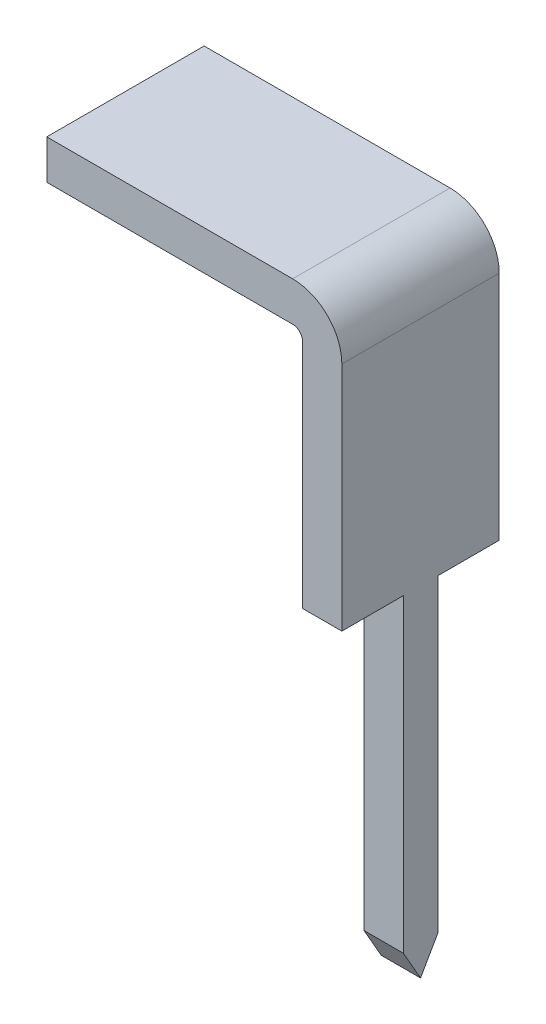
ISO-10303-21;
HEADER;
FILE_DESCRIPTION(('STEP AP214'),'2;1');
FILE_NAME('part.step','',(''),(''),'','','');
FILE_SCHEMA(('AUTOMOTIVE_DESIGN { 1 0 10303 214 1 1 1 1 }'));
ENDSEC;
DATA;
#1=APPLICATION_CONTEXT('core data for automotive mechanical design processes');
#2=APPLICATION_PROTOCOL_DEFINITION('international standard','automotive_design',2000,#1);
#3=PRODUCT_CONTEXT('',#1,'mechanical');
#4=PRODUCT('Part','Part','',(#3));
#5=PRODUCT_RELATED_PRODUCT_CATEGORY('part','',(#4));
#6=PRODUCT_DEFINITION_FORMATION('','',#4);
#7=PRODUCT_DEFINITION_CONTEXT('part definition',#1,'design');
#8=PRODUCT_DEFINITION('design','',#6,#7);
#9=PRODUCT_DEFINITION_SHAPE('','',#8);
#10=(LENGTH_UNIT() NAMED_UNIT(*) SI_UNIT(.MILLI.,.METRE.));
#11=(NAMED_UNIT(*) PLANE_ANGLE_UNIT() SI_UNIT($,.RADIAN.));
#12=(NAMED_UNIT(*) SI_UNIT($,.STERADIAN.) SOLID_ANGLE_UNIT());
#13=UNCERTAINTY_MEASURE_WITH_UNIT(LENGTH_MEASURE(1.E-05),#10,'distance_accuracy_value','');
#14=(GEOMETRIC_REPRESENTATION_CONTEXT(3) GLOBAL_UNCERTAINTY_ASSIGNED_CONTEXT((#13)) GLOBAL_UNIT_ASSIGNED_CONTEXT((#10,
#11,#12)) REPRESENTATION_CONTEXT('',''));
#15=CARTESIAN_POINT('',(0.,0.,0.));
#16=DIRECTION('',(0.,0.,1.));
#17=DIRECTION('',(1.,0.,0.));
#18=AXIS2_PLACEMENT_3D('',#15,#16,#17);
#19=CARTESIAN_POINT('',(0.,0.,1.6));
#20=DIRECTION('',(-1.,0.,0.));
#21=DIRECTION('',(0.,0.,1.));
#22=AXIS2_PLACEMENT_3D('',#19,#20,#21);
#23=PLANE('',#22);
#24=DIRECTION('',(0.,1.,0.));
#25=VECTOR('',#24,1.);
#26=CARTESIAN_POINT('',(0.,3.14810351335096,0.975));
#27=LINE('',#26,#25);
#28=CARTESIAN_POINT('',(0.,0.,0.974999999999999));
#29=VERTEX_POINT('',#28);
#30=CARTESIAN_POINT('',(0.,3.14810351335096,0.975));
#31=VERTEX_POINT('',#30);
#32=EDGE_CURVE('E146',#29,#31,#27,.T.);
#33=ORIENTED_EDGE('',*,*,#32,.F.);
#34=DIRECTION('',(0.,-0.867807842298188,-0.496899938464238));
#35=VECTOR('',#34,1.);
#36=CARTESIAN_POINT('',(0.,0.,0.974999999999999));
#37=LINE('',#36,#35);
#38=CARTESIAN_POINT('',(0.,-0.305627673997211,0.8));
#39=VERTEX_POINT('',#38);
#40=EDGE_CURVE('E132',#29,#39,#37,.T.);
#41=ORIENTED_EDGE('',*,*,#40,.T.);
#42=DIRECTION('',(0.,0.867807842298188,-0.496899938464238));
#43=VECTOR('',#42,1.);
#44=CARTESIAN_POINT('',(0.,-0.305627673997211,0.8));
#45=LINE('',#44,#43);
#46=CARTESIAN_POINT('',(0.,0.,0.625000000000001));
#47=VERTEX_POINT('',#46);
#48=EDGE_CURVE('E139',#39,#47,#45,.T.);
#49=ORIENTED_EDGE('',*,*,#48,.T.);
#50=DIRECTION('',(0.,-1.,0.));
#51=VECTOR('',#50,1.);
#52=CARTESIAN_POINT('',(0.,3.14810351335096,0.625));
#53=LINE('',#52,#51);
#54=CARTESIAN_POINT('',(0.,3.14810351335096,0.625));
#55=VERTEX_POINT('',#54);
#56=EDGE_CURVE('E158',#55,#47,#53,.T.);
#57=ORIENTED_EDGE('',*,*,#56,.F.);
#58=DIRECTION('',(0.,0.,1.));
#59=VECTOR('',#58,1.);
#60=CARTESIAN_POINT('',(0.,3.14810351335096,0.));
#61=LINE('',#60,#59);
#62=CARTESIAN_POINT('',(0.,3.14810351335096,0.));
#63=VERTEX_POINT('',#62);
#64=EDGE_CURVE('E155',#63,#55,#61,.T.);
#65=ORIENTED_EDGE('',*,*,#64,.F.);
#66=DIRECTION('',(0.,1.,0.));
#67=VECTOR('',#66,1.);
#68=CARTESIAN_POINT('',(0.,0.,0.));
#69=LINE('',#68,#67);
#70=CARTESIAN_POINT('',(0.,5.5,0.));
#71=VERTEX_POINT('',#70);
#72=EDGE_CURVE('E173',#63,#71,#69,.T.);
#73=ORIENTED_EDGE('',*,*,#72,.T.);
#74=DIRECTION('',(0.,0.,-1.));
#75=VECTOR('',#74,1.);
#76=CARTESIAN_POINT('',(0.,5.5,1.6));
#77=LINE('',#76,#75);
#78=CARTESIAN_POINT('',(0.,5.5,1.6));
#79=VERTEX_POINT('',#78);
#80=EDGE_CURVE('E218',#79,#71,#77,.T.);
#81=ORIENTED_EDGE('',*,*,#80,.F.);
#82=DIRECTION('',(0.,1.,0.));
#83=VECTOR('',#82,1.);
#84=CARTESIAN_POINT('',(0.,0.,1.6));
#85=LINE('',#84,#83);
#86=CARTESIAN_POINT('',(0.,3.14810351335096,1.6));
#87=VERTEX_POINT('',#86);
#88=EDGE_CURVE('E174',#87,#79,#85,.T.);
#89=ORIENTED_EDGE('',*,*,#88,.F.);
#90=DIRECTION('',(0.,0.,1.));
#91=VECTOR('',#90,1.);
#92=CARTESIAN_POINT('',(0.,3.14810351335096,1.6));
#93=LINE('',#92,#91);
#94=EDGE_CURVE('E54',#31,#87,#93,.T.);
#95=ORIENTED_EDGE('',*,*,#94,.F.);
#96=EDGE_LOOP('',(#33,#41,#49,#57,#65,#73,#81,#89,#95));
#97=FACE_BOUND('',#96,.T.);
#98=ADVANCED_FACE('F32',(#97),#23,.F.);
#99=CARTESIAN_POINT('',(-0.5,5.5,1.6));
#100=DIRECTION('',(0.,0.,-1.));
#101=DIRECTION('',(-1.,0.,0.));
#102=AXIS2_PLACEMENT_3D('',#99,#100,#101);
#103=CYLINDRICAL_SURFACE('',#102,0.5);
#104=CARTESIAN_POINT('',(-0.5,5.5,0.));
#105=DIRECTION('',(0.,0.,1.));
#106=DIRECTION('',(1.,0.,0.));
#107=AXIS2_PLACEMENT_3D('',#104,#105,#106);
#108=CIRCLE('',#107,0.5);
#109=CARTESIAN_POINT('',(-0.500000000000003,6.,0.));
#110=VERTEX_POINT('',#109);
#111=EDGE_CURVE('E192',#71,#110,#108,.T.);
#112=ORIENTED_EDGE('',*,*,#111,.T.);
#113=DIRECTION('',(0.,0.,-1.));
#114=VECTOR('',#113,1.);
#115=CARTESIAN_POINT('',(-0.500000000000003,6.,1.6));
#116=LINE('',#115,#114);
#117=CARTESIAN_POINT('',(-0.500000000000003,6.,1.6));
#118=VERTEX_POINT('',#117);
#119=EDGE_CURVE('E215',#118,#110,#116,.T.);
#120=ORIENTED_EDGE('',*,*,#119,.F.);
#121=CARTESIAN_POINT('',(-0.5,5.5,1.6));
#122=DIRECTION('',(0.,0.,1.));
#123=DIRECTION('',(1.,0.,0.));
#124=AXIS2_PLACEMENT_3D('',#121,#122,#123);
#125=CIRCLE('',#124,0.5);
#126=EDGE_CURVE('E176',#79,#118,#125,.T.);
#127=ORIENTED_EDGE('',*,*,#126,.F.);
#128=ORIENTED_EDGE('',*,*,#80,.T.);
#129=EDGE_LOOP('',(#112,#120,#127,#128));
#130=FACE_BOUND('',#129,.T.);
#131=ADVANCED_FACE('F256',(#130),#103,.T.);
#132=CARTESIAN_POINT('',(-0.500000000000004,6.,1.6));
#133=DIRECTION('',(0.,-1.,0.));
#134=DIRECTION('',(1.,0.,0.));
#135=AXIS2_PLACEMENT_3D('',#132,#133,#134);
#136=PLANE('',#135);
#137=DIRECTION('',(-1.,0.,0.));
#138=VECTOR('',#137,1.);
#139=CARTESIAN_POINT('',(-0.500000000000004,6.,0.));
#140=LINE('',#139,#138);
#141=CARTESIAN_POINT('',(-3.,6.,0.));
#142=VERTEX_POINT('',#141);
#143=EDGE_CURVE('E194',#110,#142,#140,.T.);
#144=ORIENTED_EDGE('',*,*,#143,.T.);
#145=DIRECTION('',(0.,0.,-1.));
#146=VECTOR('',#145,1.);
#147=CARTESIAN_POINT('',(-3.,6.,1.6));
#148=LINE('',#147,#146);
#149=CARTESIAN_POINT('',(-3.,6.,1.6));
#150=VERTEX_POINT('',#149);
#151=EDGE_CURVE('E212',#150,#142,#148,.T.);
#152=ORIENTED_EDGE('',*,*,#151,.F.);
#153=DIRECTION('',(-1.,0.,0.));
#154=VECTOR('',#153,1.);
#155=CARTESIAN_POINT('',(-0.500000000000004,6.,1.6));
#156=LINE('',#155,#154);
#157=EDGE_CURVE('E179',#118,#150,#156,.T.);
#158=ORIENTED_EDGE('',*,*,#157,.F.);
#159=ORIENTED_EDGE('',*,*,#119,.T.);
#160=EDGE_LOOP('',(#144,#152,#158,#159));
#161=FACE_BOUND('',#160,.T.);
#162=ADVANCED_FACE('F253',(#161),#136,.F.);
#163=CARTESIAN_POINT('',(-3.,6.,1.6));
#164=DIRECTION('',(1.,0.,0.));
#165=DIRECTION('',(0.,0.,-1.));
#166=AXIS2_PLACEMENT_3D('',#163,#164,#165);
#167=PLANE('',#166);
#168=DIRECTION('',(0.,-1.,0.));
#169=VECTOR('',#168,1.);
#170=CARTESIAN_POINT('',(-3.,6.,0.));
#171=LINE('',#170,#169);
#172=CARTESIAN_POINT('',(-3.,5.6,0.));
#173=VERTEX_POINT('',#172);
#174=EDGE_CURVE('E196',#142,#173,#171,.T.);
#175=ORIENTED_EDGE('',*,*,#174,.T.);
#176=DIRECTION('',(0.,0.,-1.));
#177=VECTOR('',#176,1.);
#178=CARTESIAN_POINT('',(-3.,5.6,1.6));
#179=LINE('',#178,#177);
#180=CARTESIAN_POINT('',(-3.,5.6,1.6));
#181=VERTEX_POINT('',#180);
#182=EDGE_CURVE('E209',#181,#173,#179,.T.);
#183=ORIENTED_EDGE('',*,*,#182,.F.);
#184=DIRECTION('',(0.,-1.,0.));
#185=VECTOR('',#184,1.);
#186=CARTESIAN_POINT('',(-3.,6.,1.6));
#187=LINE('',#186,#185);
#188=EDGE_CURVE('E181',#150,#181,#187,.T.);
#189=ORIENTED_EDGE('',*,*,#188,.F.);
#190=ORIENTED_EDGE('',*,*,#151,.T.);
#191=EDGE_LOOP('',(#175,#183,#189,#190));
#192=FACE_BOUND('',#191,.T.);
#193=ADVANCED_FACE('F249',(#192),#167,.F.);
#194=CARTESIAN_POINT('',(-0.500000000000001,5.6,1.6));
#195=DIRECTION('',(0.,1.,0.));
#196=DIRECTION('',(0.,0.,1.));
#197=AXIS2_PLACEMENT_3D('',#194,#195,#196);
#198=PLANE('',#197);
#199=DIRECTION('',(1.,0.,0.));
#200=VECTOR('',#199,1.);
#201=CARTESIAN_POINT('',(-0.500000000000001,5.6,0.));
#202=LINE('',#201,#200);
#203=CARTESIAN_POINT('',(-0.500000000000001,5.6,0.));
#204=VERTEX_POINT('',#203);
#205=EDGE_CURVE('E198',#173,#204,#202,.T.);
#206=ORIENTED_EDGE('',*,*,#205,.T.);
#207=DIRECTION('',(0.,0.,-1.));
#208=VECTOR('',#207,1.);
#209=CARTESIAN_POINT('',(-0.500000000000001,5.6,1.6));
#210=LINE('',#209,#208);
#211=CARTESIAN_POINT('',(-0.500000000000001,5.6,1.6));
#212=VERTEX_POINT('',#211);
#213=EDGE_CURVE('E206',#212,#204,#210,.T.);
#214=ORIENTED_EDGE('',*,*,#213,.F.);
#215=DIRECTION('',(1.,0.,0.));
#216=VECTOR('',#215,1.);
#217=CARTESIAN_POINT('',(-0.500000000000001,5.6,1.6));
#218=LINE('',#217,#216);
#219=EDGE_CURVE('E183',#181,#212,#218,.T.);
#220=ORIENTED_EDGE('',*,*,#219,.F.);
#221=ORIENTED_EDGE('',*,*,#182,.T.);
#222=EDGE_LOOP('',(#206,#214,#220,#221));
#223=FACE_BOUND('',#222,.T.);
#224=ADVANCED_FACE('F244',(#223),#198,.F.);
#225=CARTESIAN_POINT('',(-0.5,5.5,1.6));
#226=DIRECTION('',(0.,0.,-1.));
#227=DIRECTION('',(-1.,0.,0.));
#228=AXIS2_PLACEMENT_3D('',#225,#226,#227);
#229=CYLINDRICAL_SURFACE('',#228,0.1);
#230=CARTESIAN_POINT('',(-0.5,5.5,0.));
#231=DIRECTION('',(0.,0.,-1.));
#232=DIRECTION('',(1.,0.,0.));
#233=AXIS2_PLACEMENT_3D('',#230,#231,#232);
#234=CIRCLE('',#233,0.1);
#235=CARTESIAN_POINT('',(-0.4,5.5,0.));
#236=VERTEX_POINT('',#235);
#237=EDGE_CURVE('E200',#204,#236,#234,.T.);
#238=ORIENTED_EDGE('',*,*,#237,.T.);
#239=DIRECTION('',(0.,0.,-1.));
#240=VECTOR('',#239,1.);
#241=CARTESIAN_POINT('',(-0.4,5.5,1.6));
#242=LINE('',#241,#240);
#243=CARTESIAN_POINT('',(-0.4,5.5,1.6));
#244=VERTEX_POINT('',#243);
#245=EDGE_CURVE('E190',#244,#236,#242,.T.);
#246=ORIENTED_EDGE('',*,*,#245,.F.);
#247=CARTESIAN_POINT('',(-0.5,5.5,1.6));
#248=DIRECTION('',(0.,0.,-1.));
#249=DIRECTION('',(1.,0.,0.));
#250=AXIS2_PLACEMENT_3D('',#247,#248,#249);
#251=CIRCLE('',#250,0.1);
#252=EDGE_CURVE('E185',#212,#244,#251,.T.);
#253=ORIENTED_EDGE('',*,*,#252,.F.);
#254=ORIENTED_EDGE('',*,*,#213,.T.);
#255=EDGE_LOOP('',(#238,#246,#253,#254));
#256=FACE_BOUND('',#255,.T.);
#257=ADVANCED_FACE('F238',(#256),#229,.F.);
#258=CARTESIAN_POINT('',(-0.4,0.,1.6));
#259=DIRECTION('',(1.,0.,0.));
#260=DIRECTION('',(0.,0.,-1.));
#261=AXIS2_PLACEMENT_3D('',#258,#259,#260);
#262=PLANE('',#261);
#263=DIRECTION('',(0.,0.,1.));
#264=VECTOR('',#263,1.);
#265=CARTESIAN_POINT('',(-0.4,3.14810351335096,1.6));
#266=LINE('',#265,#264);
#267=CARTESIAN_POINT('',(-0.4,3.14810351335096,0.));
#268=VERTEX_POINT('',#267);
#269=CARTESIAN_POINT('',(-0.4,3.14810351335096,0.625));
#270=VERTEX_POINT('',#269);
#271=EDGE_CURVE('E46',#268,#270,#266,.T.);
#272=ORIENTED_EDGE('',*,*,#271,.T.);
#273=DIRECTION('',(0.,-1.,0.));
#274=VECTOR('',#273,1.);
#275=CARTESIAN_POINT('',(-0.4,0.,0.625000000000001));
#276=LINE('',#275,#274);
#277=CARTESIAN_POINT('',(-0.4,0.,0.625000000000001));
#278=VERTEX_POINT('',#277);
#279=EDGE_CURVE('E11',#270,#278,#276,.T.);
#280=ORIENTED_EDGE('',*,*,#279,.T.);
#281=DIRECTION('',(0.,-0.867807842298188,0.496899938464238));
#282=VECTOR('',#281,1.);
#283=CARTESIAN_POINT('',(-0.4,-0.305627673997211,0.8));
#284=LINE('',#283,#282);
#285=CARTESIAN_POINT('',(-0.4,-0.305627673997211,0.8));
#286=VERTEX_POINT('',#285);
#287=EDGE_CURVE('E138',#278,#286,#284,.T.);
#288=ORIENTED_EDGE('',*,*,#287,.T.);
#289=DIRECTION('',(0.,0.867807842298188,0.496899938464238));
#290=VECTOR('',#289,1.);
#291=CARTESIAN_POINT('',(-0.4,0.,0.974999999999999));
#292=LINE('',#291,#290);
#293=CARTESIAN_POINT('',(-0.4,0.,0.974999999999999));
#294=VERTEX_POINT('',#293);
#295=EDGE_CURVE('E134',#286,#294,#292,.T.);
#296=ORIENTED_EDGE('',*,*,#295,.T.);
#297=DIRECTION('',(0.,1.,0.));
#298=VECTOR('',#297,1.);
#299=CARTESIAN_POINT('',(-0.4,0.,0.974999999999999));
#300=LINE('',#299,#298);
#301=CARTESIAN_POINT('',(-0.4,3.14810351335096,0.975));
#302=VERTEX_POINT('',#301);
#303=EDGE_CURVE('E223',#294,#302,#300,.T.);
#304=ORIENTED_EDGE('',*,*,#303,.T.);
#305=DIRECTION('',(0.,0.,1.));
#306=VECTOR('',#305,1.);
#307=CARTESIAN_POINT('',(-0.4,3.14810351335096,1.6));
#308=LINE('',#307,#306);
#309=CARTESIAN_POINT('',(-0.4,3.14810351335096,1.6));
#310=VERTEX_POINT('',#309);
#311=EDGE_CURVE('E168',#302,#310,#308,.T.);
#312=ORIENTED_EDGE('',*,*,#311,.T.);
#313=DIRECTION('',(0.,-1.,0.));
#314=VECTOR('',#313,1.);
#315=CARTESIAN_POINT('',(-0.4,0.,1.6));
#316=LINE('',#315,#314);
#317=EDGE_CURVE('E187',#244,#310,#316,.T.);
#318=ORIENTED_EDGE('',*,*,#317,.F.);
#319=ORIENTED_EDGE('',*,*,#245,.T.);
#320=DIRECTION('',(0.,-1.,0.));
#321=VECTOR('',#320,1.);
#322=CARTESIAN_POINT('',(-0.4,0.,0.));
#323=LINE('',#322,#321);
#324=EDGE_CURVE('E177',#236,#268,#323,.T.);
#325=ORIENTED_EDGE('',*,*,#324,.T.);
#326=EDGE_LOOP('',(#272,#280,#288,#296,#304,#312,#318,#319,#325));
#327=FACE_BOUND('',#326,.T.);
#328=ADVANCED_FACE('F233',(#327),#262,.F.);
#329=CARTESIAN_POINT('',(-0.5,5.5,1.6));
#330=DIRECTION('',(0.,0.,1.));
#331=DIRECTION('',(1.,0.,0.));
#332=AXIS2_PLACEMENT_3D('',#329,#330,#331);
#333=PLANE('',#332);
#334=DIRECTION('',(-1.,0.,0.));
#335=VECTOR('',#334,1.);
#336=CARTESIAN_POINT('',(-0.5,3.14810351335096,1.6));
#337=LINE('',#336,#335);
#338=EDGE_CURVE('E221',#87,#310,#337,.T.);
#339=ORIENTED_EDGE('',*,*,#338,.F.);
#340=ORIENTED_EDGE('',*,*,#88,.T.);
#341=ORIENTED_EDGE('',*,*,#126,.T.);
#342=ORIENTED_EDGE('',*,*,#157,.T.);
#343=ORIENTED_EDGE('',*,*,#188,.T.);
#344=ORIENTED_EDGE('',*,*,#219,.T.);
#345=ORIENTED_EDGE('',*,*,#252,.T.);
#346=ORIENTED_EDGE('',*,*,#317,.T.);
#347=EDGE_LOOP('',(#339,#340,#341,#342,#343,#344,#345,#346));
#348=FACE_BOUND('',#347,.T.);
#349=ADVANCED_FACE('F268',(#348),#333,.T.);
#350=CARTESIAN_POINT('',(-0.5,5.5,0.));
#351=DIRECTION('',(0.,0.,1.));
#352=DIRECTION('',(1.,0.,0.));
#353=AXIS2_PLACEMENT_3D('',#350,#351,#352);
#354=PLANE('',#353);
#355=ORIENTED_EDGE('',*,*,#72,.F.);
#356=DIRECTION('',(-1.,0.,0.));
#357=VECTOR('',#356,1.);
#358=CARTESIAN_POINT('',(-0.5,3.14810351335096,0.));
#359=LINE('',#358,#357);
#360=EDGE_CURVE('E39',#63,#268,#359,.T.);
#361=ORIENTED_EDGE('',*,*,#360,.T.);
#362=ORIENTED_EDGE('',*,*,#324,.F.);
#363=ORIENTED_EDGE('',*,*,#237,.F.);
#364=ORIENTED_EDGE('',*,*,#205,.F.);
#365=ORIENTED_EDGE('',*,*,#174,.F.);
#366=ORIENTED_EDGE('',*,*,#143,.F.);
#367=ORIENTED_EDGE('',*,*,#111,.F.);
#368=EDGE_LOOP('',(#355,#361,#362,#363,#364,#365,#366,#367));
#369=FACE_BOUND('',#368,.T.);
#370=ADVANCED_FACE('F228',(#369),#354,.F.);
#371=CARTESIAN_POINT('',(-1.6,3.14810351335096,0.975));
#372=DIRECTION('',(0.,0.,-1.));
#373=DIRECTION('',(0.,1.,0.));
#374=AXIS2_PLACEMENT_3D('',#371,#372,#373);
#375=PLANE('',#374);
#376=ORIENTED_EDGE('',*,*,#32,.T.);
#377=DIRECTION('',(1.,0.,0.));
#378=VECTOR('',#377,1.);
#379=CARTESIAN_POINT('',(-1.6,3.14810351335096,0.975));
#380=LINE('',#379,#378);
#381=EDGE_CURVE('E166',#302,#31,#380,.T.);
#382=ORIENTED_EDGE('',*,*,#381,.F.);
#383=ORIENTED_EDGE('',*,*,#303,.F.);
#384=DIRECTION('',(-1.,0.,0.));
#385=VECTOR('',#384,1.);
#386=CARTESIAN_POINT('',(-0.4,0.,0.974999999999999));
#387=LINE('',#386,#385);
#388=EDGE_CURVE('E171',#29,#294,#387,.T.);
#389=ORIENTED_EDGE('',*,*,#388,.F.);
#390=EDGE_LOOP('',(#376,#382,#383,#389));
#391=FACE_BOUND('',#390,.T.);
#392=ADVANCED_FACE('F264',(#391),#375,.F.);
#393=CARTESIAN_POINT('',(-1.6,3.14810351335096,1.6));
#394=DIRECTION('',(0.,1.,0.));
#395=DIRECTION('',(0.,0.,1.));
#396=AXIS2_PLACEMENT_3D('',#393,#394,#395);
#397=PLANE('',#396);
#398=ORIENTED_EDGE('',*,*,#381,.T.);
#399=ORIENTED_EDGE('',*,*,#94,.T.);
#400=ORIENTED_EDGE('',*,*,#338,.T.);
#401=ORIENTED_EDGE('',*,*,#311,.F.);
#402=EDGE_LOOP('',(#398,#399,#400,#401));
#403=FACE_BOUND('',#402,.T.);
#404=ADVANCED_FACE('F266',(#403),#397,.F.);
#405=CARTESIAN_POINT('',(-1.6,3.14810351335096,0.625));
#406=DIRECTION('',(0.,0.,1.));
#407=DIRECTION('',(0.,-1.,0.));
#408=AXIS2_PLACEMENT_3D('',#405,#406,#407);
#409=PLANE('',#408);
#410=ORIENTED_EDGE('',*,*,#279,.F.);
#411=DIRECTION('',(1.,0.,0.));
#412=VECTOR('',#411,1.);
#413=CARTESIAN_POINT('',(-1.6,3.14810351335096,0.625));
#414=LINE('',#413,#412);
#415=EDGE_CURVE('E160',#270,#55,#414,.T.);
#416=ORIENTED_EDGE('',*,*,#415,.T.);
#417=ORIENTED_EDGE('',*,*,#56,.T.);
#418=DIRECTION('',(1.,0.,0.));
#419=VECTOR('',#418,1.);
#420=CARTESIAN_POINT('',(-0.4,0.,0.625000000000001));
#421=LINE('',#420,#419);
#422=EDGE_CURVE('E150',#278,#47,#421,.T.);
#423=ORIENTED_EDGE('',*,*,#422,.F.);
#424=EDGE_LOOP('',(#410,#416,#417,#423));
#425=FACE_BOUND('',#424,.T.);
#426=ADVANCED_FACE('F262',(#425),#409,.F.);
#427=CARTESIAN_POINT('',(-1.6,3.14810351335096,0.));
#428=DIRECTION('',(0.,1.,0.));
#429=DIRECTION('',(0.,0.,1.));
#430=AXIS2_PLACEMENT_3D('',#427,#428,#429);
#431=PLANE('',#430);
#432=ORIENTED_EDGE('',*,*,#360,.F.);
#433=ORIENTED_EDGE('',*,*,#64,.T.);
#434=ORIENTED_EDGE('',*,*,#415,.F.);
#435=ORIENTED_EDGE('',*,*,#271,.F.);
#436=EDGE_LOOP('',(#432,#433,#434,#435));
#437=FACE_BOUND('',#436,.T.);
#438=ADVANCED_FACE('F260',(#437),#431,.F.);
#439=CARTESIAN_POINT('',(-0.864659310799799,-0.305627673997211,0.8));
#440=DIRECTION('',(0.,-0.496899938464238,-0.867807842298188));
#441=DIRECTION('',(0.,0.867807842298188,-0.496899938464238));
#442=AXIS2_PLACEMENT_3D('',#439,#440,#441);
#443=PLANE('',#442);
#444=ORIENTED_EDGE('',*,*,#287,.F.);
#445=ORIENTED_EDGE('',*,*,#422,.T.);
#446=ORIENTED_EDGE('',*,*,#48,.F.);
#447=DIRECTION('',(1.,0.,0.));
#448=VECTOR('',#447,1.);
#449=CARTESIAN_POINT('',(-0.864659310799799,-0.305627673997211,0.8));
#450=LINE('',#449,#448);
#451=EDGE_CURVE('E128',#286,#39,#450,.T.);
#452=ORIENTED_EDGE('',*,*,#451,.F.);
#453=EDGE_LOOP('',(#444,#445,#446,#452));
#454=FACE_BOUND('',#453,.T.);
#455=ADVANCED_FACE('F149',(#454),#443,.T.);
#456=CARTESIAN_POINT('',(-0.864659310799799,0.,0.974999999999999));
#457=DIRECTION('',(0.,-0.496899938464238,0.867807842298188));
#458=DIRECTION('',(0.,-0.867807842298188,-0.496899938464238));
#459=AXIS2_PLACEMENT_3D('',#456,#457,#458);
#460=PLANE('',#459);
#461=ORIENTED_EDGE('',*,*,#295,.F.);
#462=ORIENTED_EDGE('',*,*,#451,.T.);
#463=ORIENTED_EDGE('',*,*,#40,.F.);
#464=ORIENTED_EDGE('',*,*,#388,.T.);
#465=EDGE_LOOP('',(#461,#462,#463,#464));
#466=FACE_BOUND('',#465,.T.);
#467=ADVANCED_FACE('F130',(#466),#460,.T.);
#468=CLOSED_SHELL('',(#98,#131,#162,#193,#224,#257,#328,#349,#370,#392,#404,#426,#438,#455,#467));
#469=MANIFOLD_SOLID_BREP('B2',#468);
#470=ADVANCED_BREP_SHAPE_REPRESENTATION('',(#18,#469),#14);
#471=SHAPE_DEFINITION_REPRESENTATION(#9,#470);
ENDSEC;
END-ISO-10303-21;
